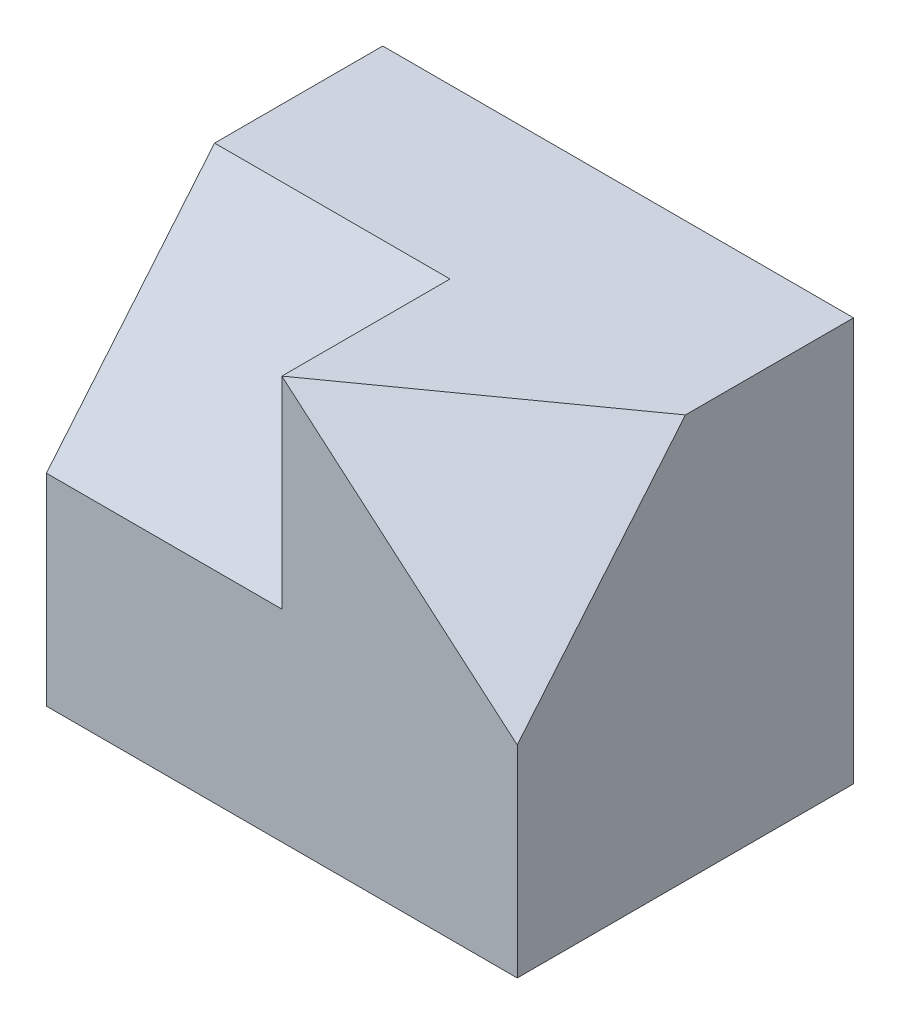
ISO-10303-21;
HEADER;
FILE_DESCRIPTION(('STEP AP214'),'2;1');
FILE_NAME('part.step','',(''),(''),'','','');
FILE_SCHEMA(('AUTOMOTIVE_DESIGN { 1 0 10303 214 1 1 1 1 }'));
ENDSEC;
DATA;
#1=APPLICATION_CONTEXT('core data for automotive mechanical design processes');
#2=APPLICATION_PROTOCOL_DEFINITION('international standard','automotive_design',2000,#1);
#3=PRODUCT_CONTEXT('',#1,'mechanical');
#4=PRODUCT('Part','Part','',(#3));
#5=PRODUCT_RELATED_PRODUCT_CATEGORY('part','',(#4));
#6=PRODUCT_DEFINITION_FORMATION('','',#4);
#7=PRODUCT_DEFINITION_CONTEXT('part definition',#1,'design');
#8=PRODUCT_DEFINITION('design','',#6,#7);
#9=PRODUCT_DEFINITION_SHAPE('','',#8);
#10=(LENGTH_UNIT() NAMED_UNIT(*) SI_UNIT(.MILLI.,.METRE.));
#11=(NAMED_UNIT(*) PLANE_ANGLE_UNIT() SI_UNIT($,.RADIAN.));
#12=(NAMED_UNIT(*) SI_UNIT($,.STERADIAN.) SOLID_ANGLE_UNIT());
#13=UNCERTAINTY_MEASURE_WITH_UNIT(LENGTH_MEASURE(1.E-05),#10,'distance_accuracy_value','');
#14=(GEOMETRIC_REPRESENTATION_CONTEXT(3) GLOBAL_UNCERTAINTY_ASSIGNED_CONTEXT((#13)) GLOBAL_UNIT_ASSIGNED_CONTEXT((#10,
#11,#12)) REPRESENTATION_CONTEXT('',''));
#15=CARTESIAN_POINT('',(0.,0.,0.));
#16=DIRECTION('',(0.,0.,1.));
#17=DIRECTION('',(1.,0.,0.));
#18=AXIS2_PLACEMENT_3D('',#15,#16,#17);
#19=CARTESIAN_POINT('',(-35.,60.,-25.));
#20=DIRECTION('',(1.,0.,0.));
#21=DIRECTION('',(0.,0.,-1.));
#22=AXIS2_PLACEMENT_3D('',#19,#20,#21);
#23=PLANE('',#22);
#24=DIRECTION('',(0.,-1.,0.));
#25=VECTOR('',#24,1.);
#26=CARTESIAN_POINT('',(-35.,60.,25.));
#27=LINE('',#26,#25);
#28=CARTESIAN_POINT('',(-35.,30.,25.));
#29=VERTEX_POINT('',#28);
#30=CARTESIAN_POINT('',(-35.,0.,25.));
#31=VERTEX_POINT('',#30);
#32=EDGE_CURVE('E41',#29,#31,#27,.T.);
#33=ORIENTED_EDGE('',*,*,#32,.F.);
#34=DIRECTION('',(0.,-0.768221279597376,0.64018439966448));
#35=VECTOR('',#34,1.);
#36=CARTESIAN_POINT('',(-35.,60.,0.));
#37=LINE('',#36,#35);
#38=CARTESIAN_POINT('',(-35.,60.,0.));
#39=VERTEX_POINT('',#38);
#40=EDGE_CURVE('E94',#39,#29,#37,.T.);
#41=ORIENTED_EDGE('',*,*,#40,.F.);
#42=DIRECTION('',(0.,0.,1.));
#43=VECTOR('',#42,1.);
#44=CARTESIAN_POINT('',(-35.,60.,-25.));
#45=LINE('',#44,#43);
#46=CARTESIAN_POINT('',(-35.,60.,-25.));
#47=VERTEX_POINT('',#46);
#48=EDGE_CURVE('E119',#47,#39,#45,.T.);
#49=ORIENTED_EDGE('',*,*,#48,.F.);
#50=DIRECTION('',(0.,-1.,0.));
#51=VECTOR('',#50,1.);
#52=CARTESIAN_POINT('',(-35.,60.,-25.));
#53=LINE('',#52,#51);
#54=CARTESIAN_POINT('',(-35.,0.,-25.));
#55=VERTEX_POINT('',#54);
#56=EDGE_CURVE('E126',#47,#55,#53,.T.);
#57=ORIENTED_EDGE('',*,*,#56,.T.);
#58=DIRECTION('',(0.,0.,1.));
#59=VECTOR('',#58,1.);
#60=CARTESIAN_POINT('',(-35.,0.,-25.));
#61=LINE('',#60,#59);
#62=EDGE_CURVE('E117',#55,#31,#61,.T.);
#63=ORIENTED_EDGE('',*,*,#62,.T.);
#64=EDGE_LOOP('',(#33,#41,#49,#57,#63));
#65=FACE_BOUND('',#64,.T.);
#66=ADVANCED_FACE('F34',(#65),#23,.F.);
#67=CARTESIAN_POINT('',(-35.,60.,25.));
#68=DIRECTION('',(0.,0.,-1.));
#69=DIRECTION('',(-1.,0.,0.));
#70=AXIS2_PLACEMENT_3D('',#67,#68,#69);
#71=PLANE('',#70);
#72=DIRECTION('',(0.,-1.,0.));
#73=VECTOR('',#72,1.);
#74=CARTESIAN_POINT('',(35.,60.,25.));
#75=LINE('',#74,#73);
#76=CARTESIAN_POINT('',(35.,30.,25.));
#77=VERTEX_POINT('',#76);
#78=CARTESIAN_POINT('',(35.,0.,25.));
#79=VERTEX_POINT('',#78);
#80=EDGE_CURVE('E107',#77,#79,#75,.T.);
#81=ORIENTED_EDGE('',*,*,#80,.F.);
#82=DIRECTION('',(-0.759256602365297,0.650791373455969,0.));
#83=VECTOR('',#82,1.);
#84=CARTESIAN_POINT('',(-20.1764705882353,77.2941176470588,25.));
#85=LINE('',#84,#83);
#86=CARTESIAN_POINT('',(0.,60.,25.));
#87=VERTEX_POINT('',#86);
#88=EDGE_CURVE('E104',#77,#87,#85,.T.);
#89=ORIENTED_EDGE('',*,*,#88,.T.);
#90=DIRECTION('',(0.,1.,0.));
#91=VECTOR('',#90,1.);
#92=CARTESIAN_POINT('',(0.,60.,25.));
#93=LINE('',#92,#91);
#94=CARTESIAN_POINT('',(0.,30.,25.));
#95=VERTEX_POINT('',#94);
#96=EDGE_CURVE('E97',#95,#87,#93,.T.);
#97=ORIENTED_EDGE('',*,*,#96,.F.);
#98=DIRECTION('',(-1.,0.,0.));
#99=VECTOR('',#98,1.);
#100=CARTESIAN_POINT('',(0.,30.,25.));
#101=LINE('',#100,#99);
#102=EDGE_CURVE('E115',#95,#29,#101,.T.);
#103=ORIENTED_EDGE('',*,*,#102,.T.);
#104=ORIENTED_EDGE('',*,*,#32,.T.);
#105=DIRECTION('',(1.,0.,0.));
#106=VECTOR('',#105,1.);
#107=CARTESIAN_POINT('',(-35.,0.,25.));
#108=LINE('',#107,#106);
#109=EDGE_CURVE('E129',#31,#79,#108,.T.);
#110=ORIENTED_EDGE('',*,*,#109,.T.);
#111=EDGE_LOOP('',(#81,#89,#97,#103,#104,#110));
#112=FACE_BOUND('',#111,.T.);
#113=ADVANCED_FACE('F105',(#112),#71,.F.);
#114=CARTESIAN_POINT('',(35.,60.,-25.));
#115=DIRECTION('',(-1.,0.,0.));
#116=DIRECTION('',(0.,0.,1.));
#117=AXIS2_PLACEMENT_3D('',#114,#115,#116);
#118=PLANE('',#117);
#119=DIRECTION('',(0.,0.,-1.));
#120=VECTOR('',#119,1.);
#121=CARTESIAN_POINT('',(35.,60.,-25.));
#122=LINE('',#121,#120);
#123=CARTESIAN_POINT('',(35.,60.,0.));
#124=VERTEX_POINT('',#123);
#125=CARTESIAN_POINT('',(35.,60.,-25.));
#126=VERTEX_POINT('',#125);
#127=EDGE_CURVE('E121',#124,#126,#122,.T.);
#128=ORIENTED_EDGE('',*,*,#127,.F.);
#129=DIRECTION('',(0.,-0.768221279597376,0.64018439966448));
#130=VECTOR('',#129,1.);
#131=CARTESIAN_POINT('',(35.,72.2950819672131,-10.2459016393442));
#132=LINE('',#131,#130);
#133=EDGE_CURVE('E48',#124,#77,#132,.T.);
#134=ORIENTED_EDGE('',*,*,#133,.T.);
#135=ORIENTED_EDGE('',*,*,#80,.T.);
#136=DIRECTION('',(0.,0.,-1.));
#137=VECTOR('',#136,1.);
#138=CARTESIAN_POINT('',(35.,0.,-25.));
#139=LINE('',#138,#137);
#140=CARTESIAN_POINT('',(35.,0.,-25.));
#141=VERTEX_POINT('',#140);
#142=EDGE_CURVE('E131',#79,#141,#139,.T.);
#143=ORIENTED_EDGE('',*,*,#142,.T.);
#144=DIRECTION('',(0.,-1.,0.));
#145=VECTOR('',#144,1.);
#146=CARTESIAN_POINT('',(35.,60.,-25.));
#147=LINE('',#146,#145);
#148=EDGE_CURVE('E136',#126,#141,#147,.T.);
#149=ORIENTED_EDGE('',*,*,#148,.F.);
#150=EDGE_LOOP('',(#128,#134,#135,#143,#149));
#151=FACE_BOUND('',#150,.T.);
#152=ADVANCED_FACE('F155',(#151),#118,.F.);
#153=CARTESIAN_POINT('',(-35.,60.,-25.));
#154=DIRECTION('',(0.,0.,1.));
#155=DIRECTION('',(1.,0.,0.));
#156=AXIS2_PLACEMENT_3D('',#153,#154,#155);
#157=PLANE('',#156);
#158=DIRECTION('',(-1.,0.,0.));
#159=VECTOR('',#158,1.);
#160=CARTESIAN_POINT('',(-35.,0.,-25.));
#161=LINE('',#160,#159);
#162=EDGE_CURVE('E122',#141,#55,#161,.T.);
#163=ORIENTED_EDGE('',*,*,#162,.T.);
#164=ORIENTED_EDGE('',*,*,#56,.F.);
#165=DIRECTION('',(-1.,0.,0.));
#166=VECTOR('',#165,1.);
#167=CARTESIAN_POINT('',(-35.,60.,-25.));
#168=LINE('',#167,#166);
#169=EDGE_CURVE('E124',#126,#47,#168,.T.);
#170=ORIENTED_EDGE('',*,*,#169,.F.);
#171=ORIENTED_EDGE('',*,*,#148,.T.);
#172=EDGE_LOOP('',(#163,#164,#170,#171));
#173=FACE_BOUND('',#172,.T.);
#174=ADVANCED_FACE('F153',(#173),#157,.F.);
#175=CARTESIAN_POINT('',(-35.,60.,25.));
#176=DIRECTION('',(0.,1.,0.));
#177=DIRECTION('',(0.,0.,1.));
#178=AXIS2_PLACEMENT_3D('',#175,#176,#177);
#179=PLANE('',#178);
#180=DIRECTION('',(-0.813733471206735,0.,0.581238193719096));
#181=VECTOR('',#180,1.);
#182=CARTESIAN_POINT('',(-23.1756756756757,60.,41.5540540540541));
#183=LINE('',#182,#181);
#184=EDGE_CURVE('E12',#124,#87,#183,.T.);
#185=ORIENTED_EDGE('',*,*,#184,.F.);
#186=ORIENTED_EDGE('',*,*,#127,.T.);
#187=ORIENTED_EDGE('',*,*,#169,.T.);
#188=ORIENTED_EDGE('',*,*,#48,.T.);
#189=DIRECTION('',(-1.,0.,0.));
#190=VECTOR('',#189,1.);
#191=CARTESIAN_POINT('',(0.,60.,0.));
#192=LINE('',#191,#190);
#193=CARTESIAN_POINT('',(0.,60.,0.));
#194=VERTEX_POINT('',#193);
#195=EDGE_CURVE('E90',#194,#39,#192,.T.);
#196=ORIENTED_EDGE('',*,*,#195,.F.);
#197=DIRECTION('',(0.,0.,-1.));
#198=VECTOR('',#197,1.);
#199=CARTESIAN_POINT('',(0.,60.,0.));
#200=LINE('',#199,#198);
#201=EDGE_CURVE('E86',#87,#194,#200,.T.);
#202=ORIENTED_EDGE('',*,*,#201,.F.);
#203=EDGE_LOOP('',(#185,#186,#187,#188,#196,#202));
#204=FACE_BOUND('',#203,.T.);
#205=ADVANCED_FACE('F88',(#204),#179,.T.);
#206=CARTESIAN_POINT('',(-35.,0.,25.));
#207=DIRECTION('',(0.,1.,0.));
#208=DIRECTION('',(0.,0.,1.));
#209=AXIS2_PLACEMENT_3D('',#206,#207,#208);
#210=PLANE('',#209);
#211=ORIENTED_EDGE('',*,*,#62,.F.);
#212=ORIENTED_EDGE('',*,*,#162,.F.);
#213=ORIENTED_EDGE('',*,*,#142,.F.);
#214=ORIENTED_EDGE('',*,*,#109,.F.);
#215=EDGE_LOOP('',(#211,#212,#213,#214));
#216=FACE_BOUND('',#215,.T.);
#217=ADVANCED_FACE('F147',(#216),#210,.F.);
#218=CARTESIAN_POINT('',(0.,60.,0.));
#219=DIRECTION('',(0.,-0.64018439966448,-0.768221279597376));
#220=DIRECTION('',(0.,0.768221279597376,-0.64018439966448));
#221=AXIS2_PLACEMENT_3D('',#218,#219,#220);
#222=PLANE('',#221);
#223=ORIENTED_EDGE('',*,*,#40,.T.);
#224=ORIENTED_EDGE('',*,*,#102,.F.);
#225=DIRECTION('',(0.,-0.768221279597376,0.64018439966448));
#226=VECTOR('',#225,1.);
#227=CARTESIAN_POINT('',(0.,60.,0.));
#228=LINE('',#227,#226);
#229=EDGE_CURVE('E93',#194,#95,#228,.T.);
#230=ORIENTED_EDGE('',*,*,#229,.F.);
#231=ORIENTED_EDGE('',*,*,#195,.T.);
#232=EDGE_LOOP('',(#223,#224,#230,#231));
#233=FACE_BOUND('',#232,.T.);
#234=ADVANCED_FACE('F180',(#233),#222,.F.);
#235=CARTESIAN_POINT('',(0.,60.,25.));
#236=DIRECTION('',(1.,0.,0.));
#237=DIRECTION('',(0.,0.,-1.));
#238=AXIS2_PLACEMENT_3D('',#235,#236,#237);
#239=PLANE('',#238);
#240=ORIENTED_EDGE('',*,*,#201,.T.);
#241=ORIENTED_EDGE('',*,*,#229,.T.);
#242=ORIENTED_EDGE('',*,*,#96,.T.);
#243=EDGE_LOOP('',(#240,#241,#242));
#244=FACE_BOUND('',#243,.T.);
#245=ADVANCED_FACE('F99',(#244),#239,.F.);
#246=CARTESIAN_POINT('',(24.2993057341219,28.3491900231422,34.0190280277706));
#247=DIRECTION('',(-0.481063363157692,-0.561240590350641,-0.673488708420769));
#248=DIRECTION('',(0.,0.768221279597376,-0.64018439966448));
#249=AXIS2_PLACEMENT_3D('',#246,#247,#248);
#250=PLANE('',#249);
#251=ORIENTED_EDGE('',*,*,#88,.F.);
#252=ORIENTED_EDGE('',*,*,#133,.F.);
#253=ORIENTED_EDGE('',*,*,#184,.T.);
#254=EDGE_LOOP('',(#251,#252,#253));
#255=FACE_BOUND('',#254,.T.);
#256=ADVANCED_FACE('F110',(#255),#250,.F.);
#257=CLOSED_SHELL('',(#66,#113,#152,#174,#205,#217,#234,#245,#256));
#258=MANIFOLD_SOLID_BREP('B2',#257);
#259=ADVANCED_BREP_SHAPE_REPRESENTATION('',(#18,#258),#14);
#260=SHAPE_DEFINITION_REPRESENTATION(#9,#259);
ENDSEC;
END-ISO-10303-21;
